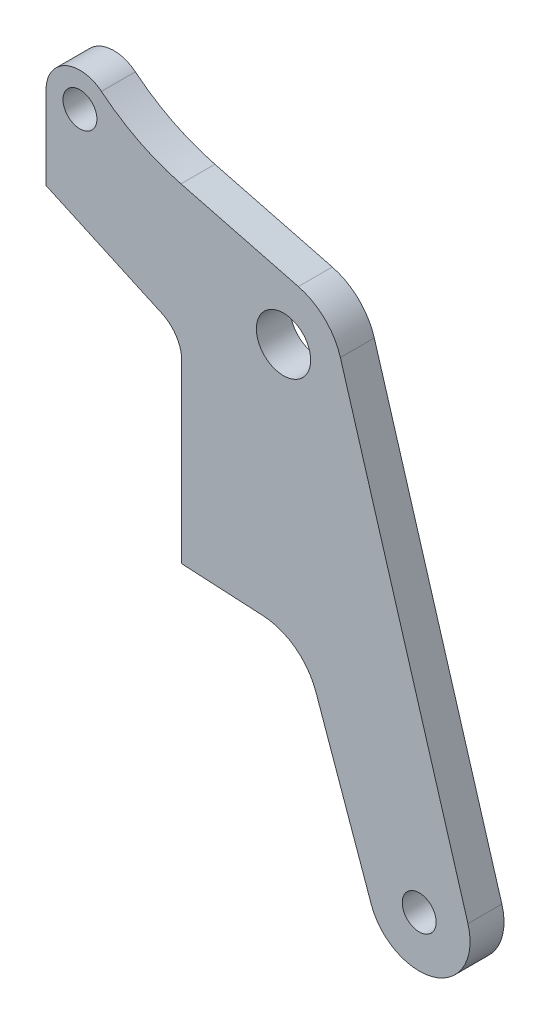
ISO-10303-21;
HEADER;
FILE_DESCRIPTION(('STEP AP214'),'2;1');
FILE_NAME('part.step','',(''),(''),'','','');
FILE_SCHEMA(('AUTOMOTIVE_DESIGN { 1 0 10303 214 1 1 1 1 }'));
ENDSEC;
DATA;
#1=APPLICATION_CONTEXT('core data for automotive mechanical design processes');
#2=APPLICATION_PROTOCOL_DEFINITION('international standard','automotive_design',2000,#1);
#3=PRODUCT_CONTEXT('',#1,'mechanical');
#4=PRODUCT('Part','Part','',(#3));
#5=PRODUCT_RELATED_PRODUCT_CATEGORY('part','',(#4));
#6=PRODUCT_DEFINITION_FORMATION('','',#4);
#7=PRODUCT_DEFINITION_CONTEXT('part definition',#1,'design');
#8=PRODUCT_DEFINITION('design','',#6,#7);
#9=PRODUCT_DEFINITION_SHAPE('','',#8);
#10=(LENGTH_UNIT() NAMED_UNIT(*) SI_UNIT(.MILLI.,.METRE.));
#11=(NAMED_UNIT(*) PLANE_ANGLE_UNIT() SI_UNIT($,.RADIAN.));
#12=(NAMED_UNIT(*) SI_UNIT($,.STERADIAN.) SOLID_ANGLE_UNIT());
#13=UNCERTAINTY_MEASURE_WITH_UNIT(LENGTH_MEASURE(1.E-05),#10,'distance_accuracy_value','');
#14=(GEOMETRIC_REPRESENTATION_CONTEXT(3) GLOBAL_UNCERTAINTY_ASSIGNED_CONTEXT((#13)) GLOBAL_UNIT_ASSIGNED_CONTEXT((#10,
#11,#12)) REPRESENTATION_CONTEXT('',''));
#15=CARTESIAN_POINT('',(0.,0.,0.));
#16=DIRECTION('',(0.,0.,1.));
#17=DIRECTION('',(1.,0.,0.));
#18=AXIS2_PLACEMENT_3D('',#15,#16,#17);
#19=CARTESIAN_POINT('',(-12.,6.,-1.));
#20=DIRECTION('',(0.,0.,1.));
#21=DIRECTION('',(1.,0.,0.));
#22=AXIS2_PLACEMENT_3D('',#19,#20,#21);
#23=CYLINDRICAL_SURFACE('',#22,2.);
#24=CARTESIAN_POINT('',(-12.,6.,1.));
#25=DIRECTION('',(0.,0.,1.));
#26=DIRECTION('',(1.,0.,0.));
#27=AXIS2_PLACEMENT_3D('',#24,#25,#26);
#28=CIRCLE('',#27,2.);
#29=CARTESIAN_POINT('',(-10.7348450824767,7.54899420097898,1.));
#30=VERTEX_POINT('',#29);
#31=CARTESIAN_POINT('',(-14.,6.,1.));
#32=VERTEX_POINT('',#31);
#33=EDGE_CURVE('E162',#30,#32,#28,.T.);
#34=ORIENTED_EDGE('',*,*,#33,.F.);
#35=DIRECTION('',(0.,0.,1.));
#36=VECTOR('',#35,1.);
#37=CARTESIAN_POINT('',(-10.7348450824767,7.54899420097898,-1.));
#38=LINE('',#37,#36);
#39=CARTESIAN_POINT('',(-10.7348450824767,7.54899420097898,-1.));
#40=VERTEX_POINT('',#39);
#41=EDGE_CURVE('E11',#40,#30,#38,.T.);
#42=ORIENTED_EDGE('',*,*,#41,.F.);
#43=CARTESIAN_POINT('',(-12.,6.,-1.));
#44=DIRECTION('',(0.,0.,1.));
#45=DIRECTION('',(1.,0.,0.));
#46=AXIS2_PLACEMENT_3D('',#43,#44,#45);
#47=CIRCLE('',#46,2.);
#48=CARTESIAN_POINT('',(-14.,6.,-1.));
#49=VERTEX_POINT('',#48);
#50=EDGE_CURVE('E198',#40,#49,#47,.T.);
#51=ORIENTED_EDGE('',*,*,#50,.T.);
#52=DIRECTION('',(0.,0.,1.));
#53=VECTOR('',#52,1.);
#54=CARTESIAN_POINT('',(-14.,6.,-1.));
#55=LINE('',#54,#53);
#56=EDGE_CURVE('E38',#49,#32,#55,.T.);
#57=ORIENTED_EDGE('',*,*,#56,.T.);
#58=EDGE_LOOP('',(#34,#42,#51,#57));
#59=FACE_BOUND('',#58,.T.);
#60=ADVANCED_FACE('F35',(#59),#23,.T.);
#61=CARTESIAN_POINT('',(-2.98181760352899,17.0414242888533,-1.));
#62=DIRECTION('',(0.,0.,1.));
#63=DIRECTION('',(1.,0.,0.));
#64=AXIS2_PLACEMENT_3D('',#61,#62,#63);
#65=CYLINDRICAL_SURFACE('',#64,12.25625);
#66=CARTESIAN_POINT('',(-2.98181760352899,17.0414242888533,1.));
#67=DIRECTION('',(0.,0.,-1.));
#68=DIRECTION('',(-1.,0.,0.));
#69=AXIS2_PLACEMENT_3D('',#66,#67,#68);
#70=CIRCLE('',#69,12.25625);
#71=CARTESIAN_POINT('',(-6.04352805539609,5.17375420701217,1.));
#72=VERTEX_POINT('',#71);
#73=EDGE_CURVE('E196',#72,#30,#70,.T.);
#74=ORIENTED_EDGE('',*,*,#73,.F.);
#75=DIRECTION('',(0.,0.,1.));
#76=VECTOR('',#75,1.);
#77=CARTESIAN_POINT('',(-6.04352805539609,5.17375420701217,-1.));
#78=LINE('',#77,#76);
#79=CARTESIAN_POINT('',(-6.04352805539609,5.17375420701217,-1.));
#80=VERTEX_POINT('',#79);
#81=EDGE_CURVE('E44',#80,#72,#78,.T.);
#82=ORIENTED_EDGE('',*,*,#81,.F.);
#83=CARTESIAN_POINT('',(-2.98181760352899,17.0414242888533,-1.));
#84=DIRECTION('',(0.,0.,-1.));
#85=DIRECTION('',(-1.,0.,0.));
#86=AXIS2_PLACEMENT_3D('',#83,#84,#85);
#87=CIRCLE('',#86,12.25625);
#88=EDGE_CURVE('E152',#80,#40,#87,.T.);
#89=ORIENTED_EDGE('',*,*,#88,.T.);
#90=ORIENTED_EDGE('',*,*,#41,.T.);
#91=EDGE_LOOP('',(#74,#82,#89,#90));
#92=FACE_BOUND('',#91,.T.);
#93=ADVANCED_FACE('F220',(#92),#65,.F.);
#94=CARTESIAN_POINT('',(0.874328328937059,3.38903378165785,-1.));
#95=DIRECTION('',(0.249808093982017,0.968295366187958,0.));
#96=DIRECTION('',(-0.968295366187958,0.249808093982017,0.));
#97=AXIS2_PLACEMENT_3D('',#94,#95,#96);
#98=PLANE('',#97);
#99=DIRECTION('',(-0.968295366187958,0.249808093982017,0.));
#100=VECTOR('',#99,1.);
#101=CARTESIAN_POINT('',(0.874328328937059,3.38903378165785,1.));
#102=LINE('',#101,#100);
#103=CARTESIAN_POINT('',(0.874328328937059,3.38903378165785,1.));
#104=VERTEX_POINT('',#103);
#105=EDGE_CURVE('E139',#104,#72,#102,.T.);
#106=ORIENTED_EDGE('',*,*,#105,.F.);
#107=DIRECTION('',(0.,0.,1.));
#108=VECTOR('',#107,1.);
#109=CARTESIAN_POINT('',(0.874328328937059,3.38903378165785,-1.));
#110=LINE('',#109,#108);
#111=CARTESIAN_POINT('',(0.874328328937059,3.38903378165785,-1.));
#112=VERTEX_POINT('',#111);
#113=EDGE_CURVE('E134',#112,#104,#110,.T.);
#114=ORIENTED_EDGE('',*,*,#113,.F.);
#115=DIRECTION('',(-0.968295366187958,0.249808093982017,0.));
#116=VECTOR('',#115,1.);
#117=CARTESIAN_POINT('',(0.874328328937059,3.38903378165785,-1.));
#118=LINE('',#117,#116);
#119=EDGE_CURVE('E137',#112,#80,#118,.T.);
#120=ORIENTED_EDGE('',*,*,#119,.T.);
#121=ORIENTED_EDGE('',*,*,#81,.T.);
#122=EDGE_LOOP('',(#106,#114,#120,#121));
#123=FACE_BOUND('',#122,.T.);
#124=ADVANCED_FACE('F136',(#123),#98,.T.);
#125=CARTESIAN_POINT('',(0.,0.,-1.));
#126=DIRECTION('',(0.,0.,1.));
#127=DIRECTION('',(1.,0.,0.));
#128=AXIS2_PLACEMENT_3D('',#125,#126,#127);
#129=CYLINDRICAL_SURFACE('',#128,3.5);
#130=CARTESIAN_POINT('',(0.,0.,1.));
#131=DIRECTION('',(0.,0.,1.));
#132=DIRECTION('',(-1.,0.,0.));
#133=AXIS2_PLACEMENT_3D('',#130,#131,#132);
#134=CIRCLE('',#133,3.5);
#135=CARTESIAN_POINT('',(3.35319899506803,1.00302367842177,1.));
#136=VERTEX_POINT('',#135);
#137=EDGE_CURVE('E193',#136,#104,#134,.T.);
#138=ORIENTED_EDGE('',*,*,#137,.F.);
#139=DIRECTION('',(0.,0.,1.));
#140=VECTOR('',#139,1.);
#141=CARTESIAN_POINT('',(3.35319899506803,1.00302367842177,-1.));
#142=LINE('',#141,#140);
#143=CARTESIAN_POINT('',(3.35319899506803,1.00302367842177,-1.));
#144=VERTEX_POINT('',#143);
#145=EDGE_CURVE('E144',#144,#136,#142,.T.);
#146=ORIENTED_EDGE('',*,*,#145,.F.);
#147=CARTESIAN_POINT('',(0.,0.,-1.));
#148=DIRECTION('',(0.,0.,1.));
#149=DIRECTION('',(-1.,0.,0.));
#150=AXIS2_PLACEMENT_3D('',#147,#148,#149);
#151=CIRCLE('',#150,3.5);
#152=EDGE_CURVE('E150',#144,#112,#151,.T.);
#153=ORIENTED_EDGE('',*,*,#152,.T.);
#154=ORIENTED_EDGE('',*,*,#113,.T.);
#155=EDGE_LOOP('',(#138,#146,#153,#154));
#156=FACE_BOUND('',#155,.T.);
#157=ADVANCED_FACE('F154',(#156),#129,.T.);
#158=CARTESIAN_POINT('',(10.8741705672012,-24.1402654184956,-1.));
#159=DIRECTION('',(0.958056855733723,0.286578193834792,0.));
#160=DIRECTION('',(-0.286578193834792,0.958056855733723,0.));
#161=AXIS2_PLACEMENT_3D('',#158,#159,#160);
#162=PLANE('',#161);
#163=DIRECTION('',(-0.286578193834792,0.958056855733723,0.));
#164=VECTOR('',#163,1.);
#165=CARTESIAN_POINT('',(10.8741705672012,-24.1402654184956,1.));
#166=LINE('',#165,#164);
#167=CARTESIAN_POINT('',(10.8741705672012,-24.1402654184956,1.));
#168=VERTEX_POINT('',#167);
#169=EDGE_CURVE('E190',#168,#136,#166,.T.);
#170=ORIENTED_EDGE('',*,*,#169,.F.);
#171=DIRECTION('',(0.,0.,1.));
#172=VECTOR('',#171,1.);
#173=CARTESIAN_POINT('',(10.8741705672012,-24.1402654184956,-1.));
#174=LINE('',#173,#172);
#175=CARTESIAN_POINT('',(10.8741705672012,-24.1402654184956,-1.));
#176=VERTEX_POINT('',#175);
#177=EDGE_CURVE('E202',#176,#168,#174,.T.);
#178=ORIENTED_EDGE('',*,*,#177,.F.);
#179=DIRECTION('',(-0.286578193834792,0.958056855733723,0.));
#180=VECTOR('',#179,1.);
#181=CARTESIAN_POINT('',(10.8741705672012,-24.1402654184956,-1.));
#182=LINE('',#181,#180);
#183=EDGE_CURVE('E155',#176,#144,#182,.T.);
#184=ORIENTED_EDGE('',*,*,#183,.T.);
#185=ORIENTED_EDGE('',*,*,#145,.T.);
#186=EDGE_LOOP('',(#170,#178,#184,#185));
#187=FACE_BOUND('',#186,.T.);
#188=ADVANCED_FACE('F233',(#187),#162,.T.);
#189=CARTESIAN_POINT('',(8.,-25.,-1.));
#190=DIRECTION('',(0.,0.,1.));
#191=DIRECTION('',(1.,0.,0.));
#192=AXIS2_PLACEMENT_3D('',#189,#190,#191);
#193=CYLINDRICAL_SURFACE('',#192,3.);
#194=CARTESIAN_POINT('',(8.,-25.,1.));
#195=DIRECTION('',(0.,0.,1.));
#196=DIRECTION('',(1.,0.,0.));
#197=AXIS2_PLACEMENT_3D('',#194,#195,#196);
#198=CIRCLE('',#197,3.);
#199=CARTESIAN_POINT('',(5.17217314504768,-26.0016962006569,1.));
#200=VERTEX_POINT('',#199);
#201=EDGE_CURVE('E187',#200,#168,#198,.T.);
#202=ORIENTED_EDGE('',*,*,#201,.F.);
#203=DIRECTION('',(0.,0.,1.));
#204=VECTOR('',#203,1.);
#205=CARTESIAN_POINT('',(5.17217314504768,-26.0016962006569,-1.));
#206=LINE('',#205,#204);
#207=CARTESIAN_POINT('',(5.17217314504768,-26.0016962006569,-1.));
#208=VERTEX_POINT('',#207);
#209=EDGE_CURVE('E204',#208,#200,#206,.T.);
#210=ORIENTED_EDGE('',*,*,#209,.F.);
#211=CARTESIAN_POINT('',(8.,-25.,-1.));
#212=DIRECTION('',(0.,0.,1.));
#213=DIRECTION('',(1.,0.,0.));
#214=AXIS2_PLACEMENT_3D('',#211,#212,#213);
#215=CIRCLE('',#214,3.);
#216=EDGE_CURVE('E157',#208,#176,#215,.T.);
#217=ORIENTED_EDGE('',*,*,#216,.T.);
#218=ORIENTED_EDGE('',*,*,#177,.T.);
#219=EDGE_LOOP('',(#202,#210,#217,#218));
#220=FACE_BOUND('',#219,.T.);
#221=ADVANCED_FACE('F236',(#220),#193,.T.);
#222=CARTESIAN_POINT('',(1.90652460401624,-16.7826449183332,-1.));
#223=DIRECTION('',(-0.942608951650775,-0.333898733552295,0.));
#224=DIRECTION('',(0.333898733552295,-0.942608951650775,0.));
#225=AXIS2_PLACEMENT_3D('',#222,#223,#224);
#226=PLANE('',#225);
#227=DIRECTION('',(0.333898733552295,-0.942608951650775,0.));
#228=VECTOR('',#227,1.);
#229=CARTESIAN_POINT('',(1.90652460401624,-16.7826449183332,1.));
#230=LINE('',#229,#228);
#231=CARTESIAN_POINT('',(1.90652460401624,-16.7826449183332,1.));
#232=VERTEX_POINT('',#231);
#233=EDGE_CURVE('E184',#232,#200,#230,.T.);
#234=ORIENTED_EDGE('',*,*,#233,.F.);
#235=DIRECTION('',(0.,0.,1.));
#236=VECTOR('',#235,1.);
#237=CARTESIAN_POINT('',(1.90652460401624,-16.7826449183332,-1.));
#238=LINE('',#237,#236);
#239=CARTESIAN_POINT('',(1.90652460401624,-16.7826449183332,-1.));
#240=VERTEX_POINT('',#239);
#241=EDGE_CURVE('E206',#240,#232,#238,.T.);
#242=ORIENTED_EDGE('',*,*,#241,.F.);
#243=DIRECTION('',(0.333898733552295,-0.942608951650775,0.));
#244=VECTOR('',#243,1.);
#245=CARTESIAN_POINT('',(1.90652460401624,-16.7826449183332,-1.));
#246=LINE('',#245,#244);
#247=EDGE_CURVE('E327',#240,#208,#246,.T.);
#248=ORIENTED_EDGE('',*,*,#247,.T.);
#249=ORIENTED_EDGE('',*,*,#209,.T.);
#250=EDGE_LOOP('',(#234,#242,#248,#249));
#251=FACE_BOUND('',#250,.T.);
#252=ADVANCED_FACE('F240',(#251),#226,.T.);
#253=CARTESIAN_POINT('',(-1.39260672676148,-17.9512904857663,-1.));
#254=DIRECTION('',(0.,0.,1.));
#255=DIRECTION('',(1.,0.,0.));
#256=AXIS2_PLACEMENT_3D('',#253,#254,#255);
#257=CYLINDRICAL_SURFACE('',#256,3.5);
#258=CARTESIAN_POINT('',(-1.39260672676148,-17.9512904857663,1.));
#259=DIRECTION('',(0.,0.,-1.));
#260=DIRECTION('',(-1.,0.,0.));
#261=AXIS2_PLACEMENT_3D('',#258,#259,#260);
#262=CIRCLE('',#261,3.5);
#263=CARTESIAN_POINT('',(-1.2060524397382,-14.4562658080289,1.));
#264=VERTEX_POINT('',#263);
#265=EDGE_CURVE('E181',#264,#232,#262,.T.);
#266=ORIENTED_EDGE('',*,*,#265,.F.);
#267=DIRECTION('',(0.,0.,1.));
#268=VECTOR('',#267,1.);
#269=CARTESIAN_POINT('',(-1.2060524397382,-14.4562658080289,-1.));
#270=LINE('',#269,#268);
#271=CARTESIAN_POINT('',(-1.2060524397382,-14.4562658080289,-1.));
#272=VERTEX_POINT('',#271);
#273=EDGE_CURVE('E208',#272,#264,#270,.T.);
#274=ORIENTED_EDGE('',*,*,#273,.F.);
#275=CARTESIAN_POINT('',(-1.39260672676148,-17.9512904857663,-1.));
#276=DIRECTION('',(0.,0.,-1.));
#277=DIRECTION('',(-1.,0.,0.));
#278=AXIS2_PLACEMENT_3D('',#275,#276,#277);
#279=CIRCLE('',#278,3.5);
#280=EDGE_CURVE('E324',#272,#240,#279,.T.);
#281=ORIENTED_EDGE('',*,*,#280,.T.);
#282=ORIENTED_EDGE('',*,*,#241,.T.);
#283=EDGE_LOOP('',(#266,#274,#281,#282));
#284=FACE_BOUND('',#283,.T.);
#285=ADVANCED_FACE('F244',(#284),#257,.F.);
#286=CARTESIAN_POINT('',(-6.,-14.2003787824441,-1.));
#287=DIRECTION('',(-0.0533012248637977,-0.998578479353535,0.));
#288=DIRECTION('',(0.998578479353535,-0.0533012248637977,0.));
#289=AXIS2_PLACEMENT_3D('',#286,#287,#288);
#290=PLANE('',#289);
#291=DIRECTION('',(0.998578479353535,-0.0533012248637977,0.));
#292=VECTOR('',#291,1.);
#293=CARTESIAN_POINT('',(-6.,-14.2003787824441,1.));
#294=LINE('',#293,#292);
#295=CARTESIAN_POINT('',(-6.,-14.2003787824441,1.));
#296=VERTEX_POINT('',#295);
#297=EDGE_CURVE('E178',#296,#264,#294,.T.);
#298=ORIENTED_EDGE('',*,*,#297,.F.);
#299=DIRECTION('',(0.,0.,1.));
#300=VECTOR('',#299,1.);
#301=CARTESIAN_POINT('',(-6.,-14.2003787824441,-1.));
#302=LINE('',#301,#300);
#303=CARTESIAN_POINT('',(-6.,-14.2003787824441,-1.));
#304=VERTEX_POINT('',#303);
#305=EDGE_CURVE('E210',#304,#296,#302,.T.);
#306=ORIENTED_EDGE('',*,*,#305,.F.);
#307=DIRECTION('',(0.998578479353535,-0.0533012248637977,0.));
#308=VECTOR('',#307,1.);
#309=CARTESIAN_POINT('',(-6.,-14.2003787824441,-1.));
#310=LINE('',#309,#308);
#311=EDGE_CURVE('E321',#304,#272,#310,.T.);
#312=ORIENTED_EDGE('',*,*,#311,.T.);
#313=ORIENTED_EDGE('',*,*,#273,.T.);
#314=EDGE_LOOP('',(#298,#306,#312,#313));
#315=FACE_BOUND('',#314,.T.);
#316=ADVANCED_FACE('F248',(#315),#290,.T.);
#317=CARTESIAN_POINT('',(-6.,-3.82497300716367,-1.));
#318=DIRECTION('',(-1.,0.,0.));
#319=DIRECTION('',(0.,0.,1.));
#320=AXIS2_PLACEMENT_3D('',#317,#318,#319);
#321=PLANE('',#320);
#322=DIRECTION('',(0.,-1.,0.));
#323=VECTOR('',#322,1.);
#324=CARTESIAN_POINT('',(-6.,-3.82497300716367,1.));
#325=LINE('',#324,#323);
#326=CARTESIAN_POINT('',(-6.,-3.82497300716367,1.));
#327=VERTEX_POINT('',#326);
#328=EDGE_CURVE('E175',#327,#296,#325,.T.);
#329=ORIENTED_EDGE('',*,*,#328,.F.);
#330=DIRECTION('',(0.,0.,1.));
#331=VECTOR('',#330,1.);
#332=CARTESIAN_POINT('',(-6.,-3.82497300716367,-1.));
#333=LINE('',#332,#331);
#334=CARTESIAN_POINT('',(-6.,-3.82497300716367,-1.));
#335=VERTEX_POINT('',#334);
#336=EDGE_CURVE('E212',#335,#327,#333,.T.);
#337=ORIENTED_EDGE('',*,*,#336,.F.);
#338=DIRECTION('',(0.,-1.,0.));
#339=VECTOR('',#338,1.);
#340=CARTESIAN_POINT('',(-6.,-3.82497300716367,-1.));
#341=LINE('',#340,#339);
#342=EDGE_CURVE('E318',#335,#304,#341,.T.);
#343=ORIENTED_EDGE('',*,*,#342,.T.);
#344=ORIENTED_EDGE('',*,*,#305,.T.);
#345=EDGE_LOOP('',(#329,#337,#343,#344));
#346=FACE_BOUND('',#345,.T.);
#347=ADVANCED_FACE('F252',(#346),#321,.T.);
#348=CARTESIAN_POINT('',(-8.,-3.82497300716366,-1.));
#349=DIRECTION('',(0.,0.,1.));
#350=DIRECTION('',(1.,0.,0.));
#351=AXIS2_PLACEMENT_3D('',#348,#349,#350);
#352=CYLINDRICAL_SURFACE('',#351,2.);
#353=CARTESIAN_POINT('',(-8.,-3.82497300716366,1.));
#354=DIRECTION('',(0.,0.,-1.));
#355=DIRECTION('',(-1.,0.,0.));
#356=AXIS2_PLACEMENT_3D('',#353,#354,#355);
#357=CIRCLE('',#356,2.);
#358=CARTESIAN_POINT('',(-7.17001353683019,-2.00532401052863,1.));
#359=VERTEX_POINT('',#358);
#360=EDGE_CURVE('E172',#359,#327,#357,.T.);
#361=ORIENTED_EDGE('',*,*,#360,.F.);
#362=DIRECTION('',(0.,0.,1.));
#363=VECTOR('',#362,1.);
#364=CARTESIAN_POINT('',(-7.17001353683019,-2.00532401052863,-1.));
#365=LINE('',#364,#363);
#366=CARTESIAN_POINT('',(-7.17001353683019,-2.00532401052863,-1.));
#367=VERTEX_POINT('',#366);
#368=EDGE_CURVE('E214',#367,#359,#365,.T.);
#369=ORIENTED_EDGE('',*,*,#368,.F.);
#370=CARTESIAN_POINT('',(-8.,-3.82497300716366,-1.));
#371=DIRECTION('',(0.,0.,-1.));
#372=DIRECTION('',(-1.,0.,0.));
#373=AXIS2_PLACEMENT_3D('',#370,#371,#372);
#374=CIRCLE('',#373,2.);
#375=EDGE_CURVE('E315',#367,#335,#374,.T.);
#376=ORIENTED_EDGE('',*,*,#375,.T.);
#377=ORIENTED_EDGE('',*,*,#336,.T.);
#378=EDGE_LOOP('',(#361,#369,#376,#377));
#379=FACE_BOUND('',#378,.T.);
#380=ADVANCED_FACE('F256',(#379),#352,.F.);
#381=CARTESIAN_POINT('',(-14.,1.11000005391844,-1.));
#382=DIRECTION('',(-0.414993231584911,-0.909824498317512,0.));
#383=DIRECTION('',(0.909824498317512,-0.414993231584911,0.));
#384=AXIS2_PLACEMENT_3D('',#381,#382,#383);
#385=PLANE('',#384);
#386=DIRECTION('',(0.909824498317512,-0.414993231584911,0.));
#387=VECTOR('',#386,1.);
#388=CARTESIAN_POINT('',(-14.,1.11000005391844,1.));
#389=LINE('',#388,#387);
#390=CARTESIAN_POINT('',(-14.,1.11000005391844,1.));
#391=VERTEX_POINT('',#390);
#392=EDGE_CURVE('E169',#391,#359,#389,.T.);
#393=ORIENTED_EDGE('',*,*,#392,.F.);
#394=DIRECTION('',(0.,0.,1.));
#395=VECTOR('',#394,1.);
#396=CARTESIAN_POINT('',(-14.,1.11000005391844,-1.));
#397=LINE('',#396,#395);
#398=CARTESIAN_POINT('',(-14.,1.11000005391844,-1.));
#399=VERTEX_POINT('',#398);
#400=EDGE_CURVE('E215',#399,#391,#397,.T.);
#401=ORIENTED_EDGE('',*,*,#400,.F.);
#402=DIRECTION('',(0.909824498317512,-0.414993231584911,0.));
#403=VECTOR('',#402,1.);
#404=CARTESIAN_POINT('',(-14.,1.11000005391844,-1.));
#405=LINE('',#404,#403);
#406=EDGE_CURVE('E312',#399,#367,#405,.T.);
#407=ORIENTED_EDGE('',*,*,#406,.T.);
#408=ORIENTED_EDGE('',*,*,#368,.T.);
#409=EDGE_LOOP('',(#393,#401,#407,#408));
#410=FACE_BOUND('',#409,.T.);
#411=ADVANCED_FACE('F260',(#410),#385,.T.);
#412=CARTESIAN_POINT('',(-14.,6.,-1.));
#413=DIRECTION('',(-1.,0.,0.));
#414=DIRECTION('',(0.,0.,1.));
#415=AXIS2_PLACEMENT_3D('',#412,#413,#414);
#416=PLANE('',#415);
#417=DIRECTION('',(0.,-1.,0.));
#418=VECTOR('',#417,1.);
#419=CARTESIAN_POINT('',(-14.,6.,1.));
#420=LINE('',#419,#418);
#421=EDGE_CURVE('E165',#32,#391,#420,.T.);
#422=ORIENTED_EDGE('',*,*,#421,.F.);
#423=ORIENTED_EDGE('',*,*,#56,.F.);
#424=DIRECTION('',(0.,-1.,0.));
#425=VECTOR('',#424,1.);
#426=CARTESIAN_POINT('',(-14.,6.,-1.));
#427=LINE('',#426,#425);
#428=EDGE_CURVE('E310',#49,#399,#427,.T.);
#429=ORIENTED_EDGE('',*,*,#428,.T.);
#430=ORIENTED_EDGE('',*,*,#400,.T.);
#431=EDGE_LOOP('',(#422,#423,#429,#430));
#432=FACE_BOUND('',#431,.T.);
#433=ADVANCED_FACE('F217',(#432),#416,.T.);
#434=CARTESIAN_POINT('',(-12.,6.,-1.));
#435=DIRECTION('',(0.,0.,1.));
#436=DIRECTION('',(1.,0.,0.));
#437=AXIS2_PLACEMENT_3D('',#434,#435,#436);
#438=PLANE('',#437);
#439=CARTESIAN_POINT('',(-12.,6.,-1.));
#440=DIRECTION('',(0.,0.,1.));
#441=DIRECTION('',(1.,0.,0.));
#442=AXIS2_PLACEMENT_3D('',#439,#440,#441);
#443=CIRCLE('',#442,1.);
#444=CARTESIAN_POINT('',(-11.,6.,-1.));
#445=VERTEX_POINT('',#444);
#446=EDGE_CURVE('E291',#445,#445,#443,.T.);
#447=ORIENTED_EDGE('',*,*,#446,.T.);
#448=EDGE_LOOP('',(#447));
#449=FACE_BOUND('',#448,.T.);
#450=CARTESIAN_POINT('',(0.,0.,-1.));
#451=DIRECTION('',(0.,0.,1.));
#452=DIRECTION('',(1.,0.,0.));
#453=AXIS2_PLACEMENT_3D('',#450,#451,#452);
#454=CIRCLE('',#453,1.6);
#455=CARTESIAN_POINT('',(1.6,0.,-1.));
#456=VERTEX_POINT('',#455);
#457=EDGE_CURVE('E299',#456,#456,#454,.T.);
#458=ORIENTED_EDGE('',*,*,#457,.T.);
#459=EDGE_LOOP('',(#458));
#460=FACE_BOUND('',#459,.T.);
#461=CARTESIAN_POINT('',(8.,-25.,-1.));
#462=DIRECTION('',(0.,0.,1.));
#463=DIRECTION('',(1.,0.,0.));
#464=AXIS2_PLACEMENT_3D('',#461,#462,#463);
#465=CIRCLE('',#464,1.);
#466=CARTESIAN_POINT('',(9.00000000000001,-25.,-1.));
#467=VERTEX_POINT('',#466);
#468=EDGE_CURVE('E166',#467,#467,#465,.T.);
#469=ORIENTED_EDGE('',*,*,#468,.T.);
#470=EDGE_LOOP('',(#469));
#471=FACE_BOUND('',#470,.T.);
#472=ORIENTED_EDGE('',*,*,#50,.F.);
#473=ORIENTED_EDGE('',*,*,#88,.F.);
#474=ORIENTED_EDGE('',*,*,#119,.F.);
#475=ORIENTED_EDGE('',*,*,#152,.F.);
#476=ORIENTED_EDGE('',*,*,#183,.F.);
#477=ORIENTED_EDGE('',*,*,#216,.F.);
#478=ORIENTED_EDGE('',*,*,#247,.F.);
#479=ORIENTED_EDGE('',*,*,#280,.F.);
#480=ORIENTED_EDGE('',*,*,#311,.F.);
#481=ORIENTED_EDGE('',*,*,#342,.F.);
#482=ORIENTED_EDGE('',*,*,#375,.F.);
#483=ORIENTED_EDGE('',*,*,#406,.F.);
#484=ORIENTED_EDGE('',*,*,#428,.F.);
#485=EDGE_LOOP('',(#472,#473,#474,#475,#476,#477,#478,#479,#480,#481,#482,#483,#484));
#486=FACE_BOUND('',#485,.T.);
#487=ADVANCED_FACE('F148',(#449,#460,#471,#486),#438,.F.);
#488=CARTESIAN_POINT('',(-12.,6.,1.));
#489=DIRECTION('',(0.,0.,1.));
#490=DIRECTION('',(1.,0.,0.));
#491=AXIS2_PLACEMENT_3D('',#488,#489,#490);
#492=PLANE('',#491);
#493=CARTESIAN_POINT('',(-12.,6.,1.));
#494=DIRECTION('',(0.,0.,1.));
#495=DIRECTION('',(1.,0.,0.));
#496=AXIS2_PLACEMENT_3D('',#493,#494,#495);
#497=CIRCLE('',#496,1.);
#498=CARTESIAN_POINT('',(-11.,6.,1.));
#499=VERTEX_POINT('',#498);
#500=EDGE_CURVE('E294',#499,#499,#497,.T.);
#501=ORIENTED_EDGE('',*,*,#500,.F.);
#502=EDGE_LOOP('',(#501));
#503=FACE_BOUND('',#502,.T.);
#504=CARTESIAN_POINT('',(0.,0.,1.));
#505=DIRECTION('',(0.,0.,1.));
#506=DIRECTION('',(1.,0.,0.));
#507=AXIS2_PLACEMENT_3D('',#504,#505,#506);
#508=CIRCLE('',#507,1.6);
#509=CARTESIAN_POINT('',(1.6,0.,1.));
#510=VERTEX_POINT('',#509);
#511=EDGE_CURVE('E296',#510,#510,#508,.T.);
#512=ORIENTED_EDGE('',*,*,#511,.F.);
#513=EDGE_LOOP('',(#512));
#514=FACE_BOUND('',#513,.T.);
#515=CARTESIAN_POINT('',(8.,-25.,1.));
#516=DIRECTION('',(0.,0.,1.));
#517=DIRECTION('',(1.,0.,0.));
#518=AXIS2_PLACEMENT_3D('',#515,#516,#517);
#519=CIRCLE('',#518,1.);
#520=CARTESIAN_POINT('',(9.00000000000001,-25.,1.));
#521=VERTEX_POINT('',#520);
#522=EDGE_CURVE('E302',#521,#521,#519,.T.);
#523=ORIENTED_EDGE('',*,*,#522,.F.);
#524=EDGE_LOOP('',(#523));
#525=FACE_BOUND('',#524,.T.);
#526=ORIENTED_EDGE('',*,*,#33,.T.);
#527=ORIENTED_EDGE('',*,*,#421,.T.);
#528=ORIENTED_EDGE('',*,*,#392,.T.);
#529=ORIENTED_EDGE('',*,*,#360,.T.);
#530=ORIENTED_EDGE('',*,*,#328,.T.);
#531=ORIENTED_EDGE('',*,*,#297,.T.);
#532=ORIENTED_EDGE('',*,*,#265,.T.);
#533=ORIENTED_EDGE('',*,*,#233,.T.);
#534=ORIENTED_EDGE('',*,*,#201,.T.);
#535=ORIENTED_EDGE('',*,*,#169,.T.);
#536=ORIENTED_EDGE('',*,*,#137,.T.);
#537=ORIENTED_EDGE('',*,*,#105,.T.);
#538=ORIENTED_EDGE('',*,*,#73,.T.);
#539=EDGE_LOOP('',(#526,#527,#528,#529,#530,#531,#532,#533,#534,#535,#536,#537,#538));
#540=FACE_BOUND('',#539,.T.);
#541=ADVANCED_FACE('F219',(#503,#514,#525,#540),#492,.T.);
#542=CARTESIAN_POINT('',(8.,-25.,-1.));
#543=DIRECTION('',(0.,0.,1.));
#544=DIRECTION('',(1.,0.,0.));
#545=AXIS2_PLACEMENT_3D('',#542,#543,#544);
#546=CYLINDRICAL_SURFACE('',#545,1.);
#547=ORIENTED_EDGE('',*,*,#468,.F.);
#548=EDGE_LOOP('',(#547));
#549=FACE_BOUND('',#548,.T.);
#550=ORIENTED_EDGE('',*,*,#522,.T.);
#551=EDGE_LOOP('',(#550));
#552=FACE_BOUND('',#551,.T.);
#553=ADVANCED_FACE('F272',(#549,#552),#546,.F.);
#554=CARTESIAN_POINT('',(0.,0.,-1.));
#555=DIRECTION('',(0.,0.,1.));
#556=DIRECTION('',(1.,0.,0.));
#557=AXIS2_PLACEMENT_3D('',#554,#555,#556);
#558=CYLINDRICAL_SURFACE('',#557,1.6);
#559=ORIENTED_EDGE('',*,*,#457,.F.);
#560=EDGE_LOOP('',(#559));
#561=FACE_BOUND('',#560,.T.);
#562=ORIENTED_EDGE('',*,*,#511,.T.);
#563=EDGE_LOOP('',(#562));
#564=FACE_BOUND('',#563,.T.);
#565=ADVANCED_FACE('F279',(#561,#564),#558,.F.);
#566=CARTESIAN_POINT('',(-12.,6.,-1.));
#567=DIRECTION('',(0.,0.,1.));
#568=DIRECTION('',(1.,0.,0.));
#569=AXIS2_PLACEMENT_3D('',#566,#567,#568);
#570=CYLINDRICAL_SURFACE('',#569,1.);
#571=ORIENTED_EDGE('',*,*,#446,.F.);
#572=EDGE_LOOP('',(#571));
#573=FACE_BOUND('',#572,.T.);
#574=ORIENTED_EDGE('',*,*,#500,.T.);
#575=EDGE_LOOP('',(#574));
#576=FACE_BOUND('',#575,.T.);
#577=ADVANCED_FACE('F283',(#573,#576),#570,.F.);
#578=CLOSED_SHELL('',(#60,#93,#124,#157,#188,#221,#252,#285,#316,#347,#380,#411,#433,#487,#541,
#553,#565,#577));
#579=MANIFOLD_SOLID_BREP('B2',#578);
#580=ADVANCED_BREP_SHAPE_REPRESENTATION('',(#18,#579),#14);
#581=SHAPE_DEFINITION_REPRESENTATION(#9,#580);
ENDSEC;
END-ISO-10303-21;
